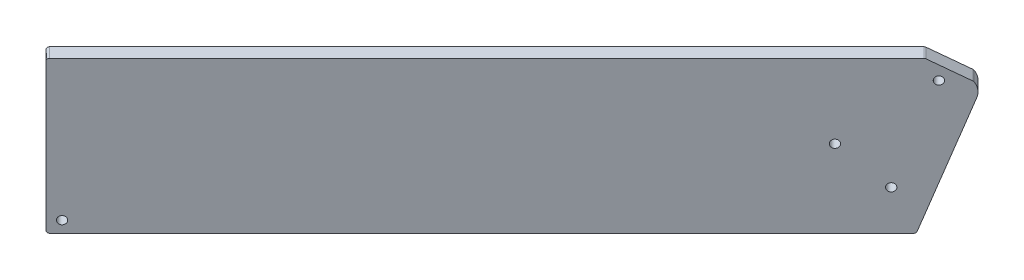
ISO-10303-21;
HEADER;
FILE_DESCRIPTION(('STEP AP214'),'2;1');
FILE_NAME('part.step','',(''),(''),'','','');
FILE_SCHEMA(('AUTOMOTIVE_DESIGN { 1 0 10303 214 1 1 1 1 }'));
ENDSEC;
DATA;
#1=APPLICATION_CONTEXT('core data for automotive mechanical design processes');
#2=APPLICATION_PROTOCOL_DEFINITION('international standard','automotive_design',2000,#1);
#3=PRODUCT_CONTEXT('',#1,'mechanical');
#4=PRODUCT('Part','Part','',(#3));
#5=PRODUCT_RELATED_PRODUCT_CATEGORY('part','',(#4));
#6=PRODUCT_DEFINITION_FORMATION('','',#4);
#7=PRODUCT_DEFINITION_CONTEXT('part definition',#1,'design');
#8=PRODUCT_DEFINITION('design','',#6,#7);
#9=PRODUCT_DEFINITION_SHAPE('','',#8);
#10=(LENGTH_UNIT() NAMED_UNIT(*) SI_UNIT(.MILLI.,.METRE.));
#11=(NAMED_UNIT(*) PLANE_ANGLE_UNIT() SI_UNIT($,.RADIAN.));
#12=(NAMED_UNIT(*) SI_UNIT($,.STERADIAN.) SOLID_ANGLE_UNIT());
#13=UNCERTAINTY_MEASURE_WITH_UNIT(LENGTH_MEASURE(1.E-05),#10,'distance_accuracy_value','');
#14=(GEOMETRIC_REPRESENTATION_CONTEXT(3) GLOBAL_UNCERTAINTY_ASSIGNED_CONTEXT((#13)) GLOBAL_UNIT_ASSIGNED_CONTEXT((#10,
#11,#12)) REPRESENTATION_CONTEXT('',''));
#15=CARTESIAN_POINT('',(0.,0.,0.));
#16=DIRECTION('',(0.,0.,1.));
#17=DIRECTION('',(1.,0.,0.));
#18=AXIS2_PLACEMENT_3D('',#15,#16,#17);
#19=CARTESIAN_POINT('',(1237.44296020864,124.968,-361.241491796263));
#20=DIRECTION('',(-0.707106781186546,0.,-0.707106781186549));
#21=DIRECTION('',(-0.707106781186549,0.,0.707106781186546));
#22=AXIS2_PLACEMENT_3D('',#19,#20,#21);
#23=CYLINDRICAL_SURFACE('',#22,2.03199999999998);
#24=CARTESIAN_POINT('',(1228.9576788344,124.968,-369.726773170502));
#25=DIRECTION('',(-0.707106781186546,0.,-0.707106781186549));
#26=DIRECTION('',(-0.707106781186549,0.,0.707106781186546));
#27=AXIS2_PLACEMENT_3D('',#24,#25,#26);
#28=CIRCLE('',#27,2.03199999999998);
#29=CARTESIAN_POINT('',(1229.67609932409,126.72776362049,-370.445193660187));
#30=VERTEX_POINT('',#29);
#31=CARTESIAN_POINT('',(1228.9576788344,127.,-369.726773170502));
#32=VERTEX_POINT('',#31);
#33=EDGE_CURVE('E92',#30,#32,#28,.F.);
#34=ORIENTED_EDGE('',*,*,#33,.T.);
#35=DIRECTION('',(0.707106781186552,0.,0.707106781186543));
#36=VECTOR('',#35,1.);
#37=CARTESIAN_POINT('',(1228.9576788344,127.,-369.726773170502));
#38=LINE('',#37,#36);
#39=CARTESIAN_POINT('',(1237.44296020864,127.,-361.241491796263));
#40=VERTEX_POINT('',#39);
#41=EDGE_CURVE('E106',#32,#40,#38,.T.);
#42=ORIENTED_EDGE('',*,*,#41,.T.);
#43=CARTESIAN_POINT('',(1237.44296020864,124.968,-361.241491796263));
#44=DIRECTION('',(-0.707106781186546,0.,-0.707106781186549));
#45=DIRECTION('',(-0.707106781186549,0.,0.707106781186546));
#46=AXIS2_PLACEMENT_3D('',#43,#44,#45);
#47=CIRCLE('',#46,2.03199999999998);
#48=CARTESIAN_POINT('',(1238.16138069832,126.72776362049,-361.959912285949));
#49=VERTEX_POINT('',#48);
#50=EDGE_CURVE('E20',#40,#49,#47,.T.);
#51=ORIENTED_EDGE('',*,*,#50,.T.);
#52=DIRECTION('',(-0.707106781186534,0.,-0.707106781186561));
#53=VECTOR('',#52,1.);
#54=CARTESIAN_POINT('',(1238.16138069832,126.72776362049,-361.959912285949));
#55=LINE('',#54,#53);
#56=EDGE_CURVE('E95',#49,#30,#55,.T.);
#57=ORIENTED_EDGE('',*,*,#56,.T.);
#58=EDGE_LOOP('',(#34,#42,#51,#57));
#59=FACE_BOUND('',#58,.T.);
#60=ADVANCED_FACE('F17',(#59),#23,.T.);
#61=CARTESIAN_POINT('',(429.615452831947,1.51770596090728E-13,429.615452831949));
#62=DIRECTION('',(0.707106781186546,0.,0.707106781186549));
#63=DIRECTION('',(0.707106781186549,0.,-0.707106781186546));
#64=AXIS2_PLACEMENT_3D('',#61,#62,#63);
#65=PLANE('',#64);
#66=ORIENTED_EDGE('',*,*,#33,.F.);
#67=DIRECTION('',(0.612372435695788,-0.50000000000001,-0.612372435695792));
#68=VECTOR('',#67,1.);
#69=CARTESIAN_POINT('',(1229.67609932409,126.72776362049,-370.445193660187));
#70=LINE('',#69,#68);
#71=CARTESIAN_POINT('',(1249.49101096678,110.548956012843,-390.260105302884));
#72=VERTEX_POINT('',#71);
#73=EDGE_CURVE('E88',#30,#72,#70,.T.);
#74=ORIENTED_EDGE('',*,*,#73,.T.);
#75=CARTESIAN_POINT('',(1248.7725904771,108.789192392353,-389.541684813198));
#76=DIRECTION('',(-0.707106781186546,0.,-0.707106781186549));
#77=DIRECTION('',(-0.707106781186549,0.,0.707106781186546));
#78=AXIS2_PLACEMENT_3D('',#75,#76,#77);
#79=CIRCLE('',#78,2.03199999999998);
#80=CARTESIAN_POINT('',(1249.95257674722,109.948627084198,-390.721671083319));
#81=VERTEX_POINT('',#80);
#82=EDGE_CURVE('E72',#81,#72,#79,.F.);
#83=ORIENTED_EDGE('',*,*,#82,.F.);
#84=CARTESIAN_POINT('',(1242.57766255896,102.702160260166,-383.346756895065));
#85=DIRECTION('',(-0.707106781186546,0.,-0.707106781186549));
#86=DIRECTION('',(-0.707106781186549,0.,0.707106781186546));
#87=AXIS2_PLACEMENT_3D('',#84,#85,#86);
#88=CIRCLE('',#87,12.7);
#89=CARTESIAN_POINT('',(1251.0163429687,98.3585044399299,-391.785437304801));
#90=VERTEX_POINT('',#89);
#91=EDGE_CURVE('E150',#90,#81,#88,.F.);
#92=ORIENTED_EDGE('',*,*,#91,.F.);
#93=DIRECTION('',(0.241844762647978,0.939692620785907,-0.241844762647977));
#94=VECTOR('',#93,1.);
#95=CARTESIAN_POINT('',(1132.57776360012,-361.836944204197,-273.346857936224));
#96=LINE('',#95,#94);
#97=CARTESIAN_POINT('',(1226.04632772148,1.33701506876224,-366.815422057582));
#98=VERTEX_POINT('',#97);
#99=EDGE_CURVE('E109',#90,#98,#96,.F.);
#100=ORIENTED_EDGE('',*,*,#99,.T.);
#101=CARTESIAN_POINT('',(1224.69613885592,2.03199999999998,-365.465233192025));
#102=DIRECTION('',(0.707106781186546,0.,0.707106781186549));
#103=DIRECTION('',(0.707106781186549,0.,-0.707106781186546));
#104=AXIS2_PLACEMENT_3D('',#101,#102,#103);
#105=CIRCLE('',#104,2.03199999999998);
#106=CARTESIAN_POINT('',(1224.69613885592,0.,-365.465233192025));
#107=VERTEX_POINT('',#106);
#108=EDGE_CURVE('E113',#107,#98,#105,.T.);
#109=ORIENTED_EDGE('',*,*,#108,.F.);
#110=DIRECTION('',(0.707106781186549,0.,-0.707106781186546));
#111=VECTOR('',#110,1.);
#112=CARTESIAN_POINT('',(862.317978549899,0.,-3.0870728860013));
#113=LINE('',#112,#111);
#114=CARTESIAN_POINT('',(862.317978549899,0.,-3.08707288600124));
#115=VERTEX_POINT('',#114);
#116=EDGE_CURVE('E114',#115,#107,#113,.T.);
#117=ORIENTED_EDGE('',*,*,#116,.F.);
#118=CARTESIAN_POINT('',(862.317978549899,2.032,-3.08707288600119));
#119=DIRECTION('',(0.707106781186546,0.,0.707106781186549));
#120=DIRECTION('',(0.707106781186549,0.,-0.707106781186546));
#121=AXIS2_PLACEMENT_3D('',#118,#119,#120);
#122=CIRCLE('',#121,2.03199999999997);
#123=CARTESIAN_POINT('',(860.881137570528,2.032,-1.65023190663016));
#124=VERTEX_POINT('',#123);
#125=EDGE_CURVE('E154',#124,#115,#122,.T.);
#126=ORIENTED_EDGE('',*,*,#125,.F.);
#127=DIRECTION('',(0.,1.,0.));
#128=VECTOR('',#127,1.);
#129=CARTESIAN_POINT('',(860.881137570528,1.53435930627666E-13,-1.65023190663015));
#130=LINE('',#129,#128);
#131=CARTESIAN_POINT('',(860.881137570528,124.968,-1.65023190663011));
#132=VERTEX_POINT('',#131);
#133=EDGE_CURVE('E119',#124,#132,#130,.T.);
#134=ORIENTED_EDGE('',*,*,#133,.T.);
#135=CARTESIAN_POINT('',(862.317978549899,124.968,-3.08707288600111));
#136=DIRECTION('',(-0.707106781186546,0.,-0.707106781186549));
#137=DIRECTION('',(-0.707106781186549,0.,0.707106781186546));
#138=AXIS2_PLACEMENT_3D('',#135,#136,#137);
#139=CIRCLE('',#138,2.03199999999997);
#140=CARTESIAN_POINT('',(862.317978549899,127.,-3.08707288600111));
#141=VERTEX_POINT('',#140);
#142=EDGE_CURVE('E123',#141,#132,#139,.F.);
#143=ORIENTED_EDGE('',*,*,#142,.F.);
#144=DIRECTION('',(0.707106781186549,0.,-0.707106781186546));
#145=VECTOR('',#144,1.);
#146=CARTESIAN_POINT('',(862.317978549899,127.,-3.08707288600124));
#147=LINE('',#146,#145);
#148=EDGE_CURVE('E94',#141,#32,#147,.T.);
#149=ORIENTED_EDGE('',*,*,#148,.T.);
#150=EDGE_LOOP('',(#66,#74,#83,#92,#100,#109,#117,#126,#134,#143,#149));
#151=FACE_BOUND('',#150,.T.);
#152=CARTESIAN_POINT('',(1191.59579018666,65.0166698736605,-332.364884522763));
#153=DIRECTION('',(-0.707106781186546,0.,-0.707106781186549));
#154=DIRECTION('',(-0.707106781186549,0.,0.707106781186546));
#155=AXIS2_PLACEMENT_3D('',#152,#153,#154);
#156=CIRCLE('',#155,3.35279999999997);
#157=CARTESIAN_POINT('',(1189.2250025707,65.0166698736605,-329.994096906801));
#158=VERTEX_POINT('',#157);
#159=EDGE_CURVE('E99',#158,#158,#156,.F.);
#160=ORIENTED_EDGE('',*,*,#159,.T.);
#161=EDGE_LOOP('',(#160));
#162=FACE_BOUND('',#161,.T.);
#163=CARTESIAN_POINT('',(1235.14419067495,110.951573739276,-375.913285011051));
#164=DIRECTION('',(-0.707106781186546,0.,-0.707106781186549));
#165=DIRECTION('',(-0.707106781186549,0.,0.707106781186546));
#166=AXIS2_PLACEMENT_3D('',#163,#164,#165);
#167=CIRCLE('',#166,3.35279999999833);
#168=CARTESIAN_POINT('',(1232.77340305899,110.951573739276,-373.54249739509));
#169=VERTEX_POINT('',#168);
#170=EDGE_CURVE('E103',#169,#169,#167,.F.);
#171=ORIENTED_EDGE('',*,*,#170,.T.);
#172=EDGE_LOOP('',(#171));
#173=FACE_BOUND('',#172,.T.);
#174=CARTESIAN_POINT('',(1215.17990551836,33.3799478933991,-355.94899985446));
#175=DIRECTION('',(-0.707106781186546,0.,-0.707106781186549));
#176=DIRECTION('',(-0.707106781186549,0.,0.707106781186546));
#177=AXIS2_PLACEMENT_3D('',#174,#175,#176);
#178=CIRCLE('',#177,3.35279999999997);
#179=CARTESIAN_POINT('',(1212.8091179024,33.3799478933991,-353.578212238497));
#180=VERTEX_POINT('',#179);
#181=EDGE_CURVE('E163',#180,#180,#178,.F.);
#182=ORIENTED_EDGE('',*,*,#181,.T.);
#183=EDGE_LOOP('',(#182));
#184=FACE_BOUND('',#183,.T.);
#185=CARTESIAN_POINT('',(867.61632966133,9.52499999999993,-8.38542399743178));
#186=DIRECTION('',(0.707106781186546,0.,0.707106781186549));
#187=DIRECTION('',(0.707106781186549,0.,-0.707106781186546));
#188=AXIS2_PLACEMENT_3D('',#185,#186,#187);
#189=CIRCLE('',#188,3.35280000000009);
#190=CARTESIAN_POINT('',(869.987117277292,9.52499999999993,-10.7562116133941));
#191=VERTEX_POINT('',#190);
#192=EDGE_CURVE('E84',#191,#191,#189,.T.);
#193=ORIENTED_EDGE('',*,*,#192,.T.);
#194=EDGE_LOOP('',(#193));
#195=FACE_BOUND('',#194,.T.);
#196=ADVANCED_FACE('F89',(#151,#162,#173,#184,#195),#65,.F.);
#197=CARTESIAN_POINT('',(1257.25787185134,108.789192392353,-381.056403438959));
#198=DIRECTION('',(-0.707106781186546,0.,-0.707106781186549));
#199=DIRECTION('',(-0.707106781186549,0.,0.707106781186546));
#200=AXIS2_PLACEMENT_3D('',#197,#198,#199);
#201=CYLINDRICAL_SURFACE('',#200,2.03199999999998);
#202=ORIENTED_EDGE('',*,*,#82,.T.);
#203=DIRECTION('',(0.707106781186557,0.,0.707106781186538));
#204=VECTOR('',#203,1.);
#205=CARTESIAN_POINT('',(1249.49101096678,110.548956012843,-390.260105302884));
#206=LINE('',#205,#204);
#207=CARTESIAN_POINT('',(1257.97629234102,110.548956012843,-381.774823928645));
#208=VERTEX_POINT('',#207);
#209=EDGE_CURVE('E80',#72,#208,#206,.T.);
#210=ORIENTED_EDGE('',*,*,#209,.T.);
#211=CARTESIAN_POINT('',(1257.25787185134,108.789192392353,-381.056403438959));
#212=DIRECTION('',(-0.707106781186546,0.,-0.707106781186549));
#213=DIRECTION('',(-0.707106781186549,0.,0.707106781186546));
#214=AXIS2_PLACEMENT_3D('',#211,#212,#213);
#215=CIRCLE('',#214,2.03199999999998);
#216=CARTESIAN_POINT('',(1258.43785812146,109.948627084198,-382.23638970908));
#217=VERTEX_POINT('',#216);
#218=EDGE_CURVE('E35',#208,#217,#215,.T.);
#219=ORIENTED_EDGE('',*,*,#218,.T.);
#220=DIRECTION('',(-0.707106781186546,0.,-0.707106781186549));
#221=VECTOR('',#220,1.);
#222=CARTESIAN_POINT('',(1258.43785812146,109.948627084198,-382.23638970908));
#223=LINE('',#222,#221);
#224=EDGE_CURVE('E82',#81,#217,#223,.F.);
#225=ORIENTED_EDGE('',*,*,#224,.F.);
#226=EDGE_LOOP('',(#202,#210,#219,#225));
#227=FACE_BOUND('',#226,.T.);
#228=ADVANCED_FACE('F78',(#227),#201,.T.);
#229=CARTESIAN_POINT('',(672.277939106578,9.52499999999986,-203.723814552185));
#230=DIRECTION('',(0.707106781186546,0.,0.707106781186549));
#231=DIRECTION('',(0.707106781186549,0.,-0.707106781186546));
#232=AXIS2_PLACEMENT_3D('',#229,#230,#231);
#233=CYLINDRICAL_SURFACE('',#232,3.35280000000009);
#234=CARTESIAN_POINT('',(876.101611035568,9.52499999999994,0.0998573768066779));
#235=DIRECTION('',(0.707106781186546,0.,0.707106781186549));
#236=DIRECTION('',(0.707106781186549,0.,-0.707106781186546));
#237=AXIS2_PLACEMENT_3D('',#234,#235,#236);
#238=CIRCLE('',#237,3.35280000000009);
#239=CARTESIAN_POINT('',(878.472398651531,9.52499999999994,-2.27093023915564));
#240=VERTEX_POINT('',#239);
#241=EDGE_CURVE('E146',#240,#240,#238,.F.);
#242=ORIENTED_EDGE('',*,*,#241,.F.);
#243=EDGE_LOOP('',(#242));
#244=FACE_BOUND('',#243,.T.);
#245=ORIENTED_EDGE('',*,*,#192,.F.);
#246=EDGE_LOOP('',(#245));
#247=FACE_BOUND('',#246,.T.);
#248=ADVANCED_FACE('F350',(#244,#247),#233,.F.);
#249=CARTESIAN_POINT('',(1223.6651868926,33.3799478933991,-347.463718480221));
#250=DIRECTION('',(-0.707106781186546,0.,-0.707106781186549));
#251=DIRECTION('',(-0.707106781186549,0.,0.707106781186546));
#252=AXIS2_PLACEMENT_3D('',#249,#250,#251);
#253=CYLINDRICAL_SURFACE('',#252,3.35279999999997);
#254=ORIENTED_EDGE('',*,*,#181,.F.);
#255=EDGE_LOOP('',(#254));
#256=FACE_BOUND('',#255,.T.);
#257=CARTESIAN_POINT('',(1223.6651868926,33.3799478933991,-347.463718480221));
#258=DIRECTION('',(-0.707106781186546,0.,-0.707106781186549));
#259=DIRECTION('',(-0.707106781186549,0.,0.707106781186546));
#260=AXIS2_PLACEMENT_3D('',#257,#258,#259);
#261=CIRCLE('',#260,3.35279999999997);
#262=CARTESIAN_POINT('',(1221.29439927664,33.3799478933991,-345.092930864259));
#263=VERTEX_POINT('',#262);
#264=EDGE_CURVE('E143',#263,#263,#261,.T.);
#265=ORIENTED_EDGE('',*,*,#264,.F.);
#266=EDGE_LOOP('',(#265));
#267=FACE_BOUND('',#266,.T.);
#268=ADVANCED_FACE('F340',(#256,#267),#253,.F.);
#269=CARTESIAN_POINT('',(1243.62947204919,110.951573739276,-367.428003636812));
#270=DIRECTION('',(-0.707106781186546,0.,-0.707106781186549));
#271=DIRECTION('',(-0.707106781186549,0.,0.707106781186546));
#272=AXIS2_PLACEMENT_3D('',#269,#270,#271);
#273=CYLINDRICAL_SURFACE('',#272,3.35279999999833);
#274=ORIENTED_EDGE('',*,*,#170,.F.);
#275=EDGE_LOOP('',(#274));
#276=FACE_BOUND('',#275,.T.);
#277=CARTESIAN_POINT('',(1243.62947204919,110.951573739276,-367.428003636812));
#278=DIRECTION('',(-0.707106781186546,0.,-0.707106781186549));
#279=DIRECTION('',(-0.707106781186549,0.,0.707106781186546));
#280=AXIS2_PLACEMENT_3D('',#277,#278,#279);
#281=CIRCLE('',#280,3.35279999999833);
#282=CARTESIAN_POINT('',(1241.25868443323,110.951573739276,-365.057216020851));
#283=VERTEX_POINT('',#282);
#284=EDGE_CURVE('E140',#283,#283,#281,.T.);
#285=ORIENTED_EDGE('',*,*,#284,.F.);
#286=EDGE_LOOP('',(#285));
#287=FACE_BOUND('',#286,.T.);
#288=ADVANCED_FACE('F330',(#276,#287),#273,.F.);
#289=CARTESIAN_POINT('',(1200.0810715609,65.0166698736605,-323.879603148524));
#290=DIRECTION('',(-0.707106781186546,0.,-0.707106781186549));
#291=DIRECTION('',(-0.707106781186549,0.,0.707106781186546));
#292=AXIS2_PLACEMENT_3D('',#289,#290,#291);
#293=CYLINDRICAL_SURFACE('',#292,3.35279999999997);
#294=ORIENTED_EDGE('',*,*,#159,.F.);
#295=EDGE_LOOP('',(#294));
#296=FACE_BOUND('',#295,.T.);
#297=CARTESIAN_POINT('',(1200.0810715609,65.0166698736605,-323.879603148524));
#298=DIRECTION('',(-0.707106781186546,0.,-0.707106781186549));
#299=DIRECTION('',(-0.707106781186549,0.,0.707106781186546));
#300=AXIS2_PLACEMENT_3D('',#297,#298,#299);
#301=CIRCLE('',#300,3.35279999999997);
#302=CARTESIAN_POINT('',(1197.71028394494,65.0166698736605,-321.508815532562));
#303=VERTEX_POINT('',#302);
#304=EDGE_CURVE('E137',#303,#303,#301,.T.);
#305=ORIENTED_EDGE('',*,*,#304,.F.);
#306=EDGE_LOOP('',(#305));
#307=FACE_BOUND('',#306,.T.);
#308=ADVANCED_FACE('F321',(#296,#307),#293,.F.);
#309=CARTESIAN_POINT('',(676.918190468507,584.980909512114,199.283277943867));
#310=DIRECTION('',(-0.353553390593279,-0.866025403784435,0.353553390593278));
#311=DIRECTION('',(0.925820099772549,-0.377964473009234,0.));
#312=AXIS2_PLACEMENT_3D('',#309,#310,#311);
#313=PLANE('',#312);
#314=ORIENTED_EDGE('',*,*,#56,.F.);
#315=DIRECTION('',(-0.61237243569579,0.500000000000006,0.612372435695794));
#316=VECTOR('',#315,1.);
#317=CARTESIAN_POINT('',(1257.97629234102,110.548956012843,-381.774823928645));
#318=LINE('',#317,#316);
#319=EDGE_CURVE('E98',#208,#49,#318,.T.);
#320=ORIENTED_EDGE('',*,*,#319,.F.);
#321=ORIENTED_EDGE('',*,*,#209,.F.);
#322=ORIENTED_EDGE('',*,*,#73,.F.);
#323=EDGE_LOOP('',(#314,#320,#321,#322));
#324=FACE_BOUND('',#323,.T.);
#325=ADVANCED_FACE('F97',(#324),#313,.F.);
#326=CARTESIAN_POINT('',(438.100734206186,127.,438.100734206187));
#327=DIRECTION('',(0.,-1.,0.));
#328=DIRECTION('',(1.,0.,0.));
#329=AXIS2_PLACEMENT_3D('',#326,#327,#328);
#330=PLANE('',#329);
#331=ORIENTED_EDGE('',*,*,#41,.F.);
#332=ORIENTED_EDGE('',*,*,#148,.F.);
#333=DIRECTION('',(-0.707106781186546,0.,-0.707106781186549));
#334=VECTOR('',#333,1.);
#335=CARTESIAN_POINT('',(870.803259924137,127.,5.39820848823735));
#336=LINE('',#335,#334);
#337=CARTESIAN_POINT('',(870.803259924138,127.,5.39820848823739));
#338=VERTEX_POINT('',#337);
#339=EDGE_CURVE('E159',#338,#141,#336,.T.);
#340=ORIENTED_EDGE('',*,*,#339,.F.);
#341=DIRECTION('',(0.707106781186549,0.,-0.707106781186546));
#342=VECTOR('',#341,1.);
#343=CARTESIAN_POINT('',(438.100734206186,127.,438.100734206187));
#344=LINE('',#343,#342);
#345=EDGE_CURVE('E136',#40,#338,#344,.F.);
#346=ORIENTED_EDGE('',*,*,#345,.F.);
#347=EDGE_LOOP('',(#331,#332,#340,#346));
#348=FACE_BOUND('',#347,.T.);
#349=ADVANCED_FACE('F174',(#348),#330,.F.);
#350=CARTESIAN_POINT('',(870.803259924137,124.968,5.39820848823735));
#351=DIRECTION('',(-0.707106781186546,0.,-0.707106781186549));
#352=DIRECTION('',(-0.707106781186549,0.,0.707106781186546));
#353=AXIS2_PLACEMENT_3D('',#350,#351,#352);
#354=CYLINDRICAL_SURFACE('',#353,2.03199999999997);
#355=ORIENTED_EDGE('',*,*,#142,.T.);
#356=DIRECTION('',(-0.707106781186546,0.,-0.707106781186549));
#357=VECTOR('',#356,1.);
#358=CARTESIAN_POINT('',(869.366418944766,124.968,6.83504946760842));
#359=LINE('',#358,#357);
#360=CARTESIAN_POINT('',(869.366418944767,124.968,6.83504946760839));
#361=VERTEX_POINT('',#360);
#362=EDGE_CURVE('E122',#132,#361,#359,.F.);
#363=ORIENTED_EDGE('',*,*,#362,.T.);
#364=CARTESIAN_POINT('',(870.803259924137,124.968,5.39820848823736));
#365=DIRECTION('',(-0.707106781186546,0.,-0.707106781186549));
#366=DIRECTION('',(-0.707106781186549,0.,0.707106781186546));
#367=AXIS2_PLACEMENT_3D('',#364,#365,#366);
#368=CIRCLE('',#367,2.03199999999997);
#369=EDGE_CURVE('E133',#338,#361,#368,.F.);
#370=ORIENTED_EDGE('',*,*,#369,.F.);
#371=ORIENTED_EDGE('',*,*,#339,.T.);
#372=EDGE_LOOP('',(#355,#363,#370,#371));
#373=FACE_BOUND('',#372,.T.);
#374=ADVANCED_FACE('F231',(#373),#354,.T.);
#375=CARTESIAN_POINT('',(869.366418944766,1.53435930627666E-13,6.83504946760842));
#376=DIRECTION('',(0.707106781186549,0.,-0.707106781186546));
#377=DIRECTION('',(-0.707106781186546,0.,-0.707106781186549));
#378=AXIS2_PLACEMENT_3D('',#375,#376,#377);
#379=PLANE('',#378);
#380=ORIENTED_EDGE('',*,*,#362,.F.);
#381=ORIENTED_EDGE('',*,*,#133,.F.);
#382=DIRECTION('',(0.707106781186546,0.,0.707106781186549));
#383=VECTOR('',#382,1.);
#384=CARTESIAN_POINT('',(869.366418944766,2.032,6.8350494676084));
#385=LINE('',#384,#383);
#386=CARTESIAN_POINT('',(869.366418944767,2.032,6.8350494676084));
#387=VERTEX_POINT('',#386);
#388=EDGE_CURVE('E157',#387,#124,#385,.F.);
#389=ORIENTED_EDGE('',*,*,#388,.F.);
#390=DIRECTION('',(0.,1.,0.));
#391=VECTOR('',#390,1.);
#392=CARTESIAN_POINT('',(869.366418944767,1.53435930627666E-13,6.83504946760843));
#393=LINE('',#392,#391);
#394=EDGE_CURVE('E132',#361,#387,#393,.F.);
#395=ORIENTED_EDGE('',*,*,#394,.F.);
#396=EDGE_LOOP('',(#380,#381,#389,#395));
#397=FACE_BOUND('',#396,.T.);
#398=ADVANCED_FACE('F233',(#397),#379,.F.);
#399=CARTESIAN_POINT('',(870.803259924137,2.032,5.39820848823735));
#400=DIRECTION('',(0.707106781186546,0.,0.707106781186549));
#401=DIRECTION('',(0.707106781186549,0.,-0.707106781186546));
#402=AXIS2_PLACEMENT_3D('',#399,#400,#401);
#403=CYLINDRICAL_SURFACE('',#402,2.03199999999997);
#404=ORIENTED_EDGE('',*,*,#125,.T.);
#405=DIRECTION('',(-0.707106781186534,0.,-0.707106781186561));
#406=VECTOR('',#405,1.);
#407=CARTESIAN_POINT('',(870.803259924137,0.,5.39820848823735));
#408=LINE('',#407,#406);
#409=CARTESIAN_POINT('',(870.803259924138,0.,5.39820848823739));
#410=VERTEX_POINT('',#409);
#411=EDGE_CURVE('E118',#410,#115,#408,.T.);
#412=ORIENTED_EDGE('',*,*,#411,.F.);
#413=CARTESIAN_POINT('',(870.803259924137,2.032,5.39820848823734));
#414=DIRECTION('',(0.707106781186546,0.,0.707106781186549));
#415=DIRECTION('',(0.707106781186549,0.,-0.707106781186546));
#416=AXIS2_PLACEMENT_3D('',#413,#414,#415);
#417=CIRCLE('',#416,2.03199999999997);
#418=EDGE_CURVE('E129',#387,#410,#417,.T.);
#419=ORIENTED_EDGE('',*,*,#418,.F.);
#420=ORIENTED_EDGE('',*,*,#388,.T.);
#421=EDGE_LOOP('',(#404,#412,#419,#420));
#422=FACE_BOUND('',#421,.T.);
#423=ADVANCED_FACE('F237',(#422),#403,.T.);
#424=CARTESIAN_POINT('',(438.100734206186,0.,438.100734206187));
#425=DIRECTION('',(0.,-1.,0.));
#426=DIRECTION('',(0.,0.,-1.));
#427=AXIS2_PLACEMENT_3D('',#424,#425,#426);
#428=PLANE('',#427);
#429=ORIENTED_EDGE('',*,*,#116,.T.);
#430=DIRECTION('',(0.707106781186546,0.,0.707106781186549));
#431=VECTOR('',#430,1.);
#432=CARTESIAN_POINT('',(1233.18142023016,0.,-356.979951817786));
#433=LINE('',#432,#431);
#434=CARTESIAN_POINT('',(1233.18142023016,0.,-356.979951817786));
#435=VERTEX_POINT('',#434);
#436=EDGE_CURVE('E117',#435,#107,#433,.F.);
#437=ORIENTED_EDGE('',*,*,#436,.F.);
#438=DIRECTION('',(0.707106781186549,0.,-0.707106781186546));
#439=VECTOR('',#438,1.);
#440=CARTESIAN_POINT('',(438.100734206186,0.,438.100734206187));
#441=LINE('',#440,#439);
#442=EDGE_CURVE('E128',#410,#435,#441,.T.);
#443=ORIENTED_EDGE('',*,*,#442,.F.);
#444=ORIENTED_EDGE('',*,*,#411,.T.);
#445=EDGE_LOOP('',(#429,#437,#443,#444));
#446=FACE_BOUND('',#445,.T.);
#447=ADVANCED_FACE('F239',(#446),#428,.T.);
#448=CARTESIAN_POINT('',(1233.18142023016,2.03199999999998,-356.979951817786));
#449=DIRECTION('',(0.707106781186546,0.,0.707106781186549));
#450=DIRECTION('',(0.707106781186549,0.,-0.707106781186546));
#451=AXIS2_PLACEMENT_3D('',#448,#449,#450);
#452=CYLINDRICAL_SURFACE('',#451,2.03199999999998);
#453=ORIENTED_EDGE('',*,*,#108,.T.);
#454=DIRECTION('',(0.707106781186546,0.,0.707106781186549));
#455=VECTOR('',#454,1.);
#456=CARTESIAN_POINT('',(1234.53160909572,1.33701506876227,-358.330140683344));
#457=LINE('',#456,#455);
#458=CARTESIAN_POINT('',(1234.53160909572,1.33701506876225,-358.330140683344));
#459=VERTEX_POINT('',#458);
#460=EDGE_CURVE('E112',#98,#459,#457,.T.);
#461=ORIENTED_EDGE('',*,*,#460,.T.);
#462=CARTESIAN_POINT('',(1233.18142023016,2.03199999999998,-356.979951817786));
#463=DIRECTION('',(0.707106781186546,0.,0.707106781186549));
#464=DIRECTION('',(0.707106781186549,0.,-0.707106781186546));
#465=AXIS2_PLACEMENT_3D('',#462,#463,#464);
#466=CIRCLE('',#465,2.03199999999998);
#467=EDGE_CURVE('E125',#435,#459,#466,.T.);
#468=ORIENTED_EDGE('',*,*,#467,.F.);
#469=ORIENTED_EDGE('',*,*,#436,.T.);
#470=EDGE_LOOP('',(#453,#461,#468,#469));
#471=FACE_BOUND('',#470,.T.);
#472=ADVANCED_FACE('F241',(#471),#452,.T.);
#473=CARTESIAN_POINT('',(1141.06304497436,-361.836944204197,-264.861576561985));
#474=DIRECTION('',(-0.664463024388675,0.342020143325672,0.664463024388673));
#475=DIRECTION('',(0.707106781186546,0.,0.707106781186549));
#476=AXIS2_PLACEMENT_3D('',#473,#474,#475);
#477=PLANE('',#476);
#478=ORIENTED_EDGE('',*,*,#460,.F.);
#479=ORIENTED_EDGE('',*,*,#99,.F.);
#480=DIRECTION('',(-0.707106781186546,0.,-0.707106781186549));
#481=VECTOR('',#480,1.);
#482=CARTESIAN_POINT('',(1259.50162434294,98.35850443993,-383.300155930563));
#483=LINE('',#482,#481);
#484=CARTESIAN_POINT('',(1259.50162434294,98.3585044399299,-383.300155930563));
#485=VERTEX_POINT('',#484);
#486=EDGE_CURVE('E149',#485,#90,#483,.T.);
#487=ORIENTED_EDGE('',*,*,#486,.F.);
#488=DIRECTION('',(0.241844762647979,0.939692620785907,-0.241844762647976));
#489=VECTOR('',#488,1.);
#490=CARTESIAN_POINT('',(1234.53160909572,1.33701506876222,-358.330140683344));
#491=LINE('',#490,#489);
#492=EDGE_CURVE('E26',#459,#485,#491,.T.);
#493=ORIENTED_EDGE('',*,*,#492,.F.);
#494=EDGE_LOOP('',(#478,#479,#487,#493));
#495=FACE_BOUND('',#494,.T.);
#496=ADVANCED_FACE('F205',(#495),#477,.F.);
#497=CARTESIAN_POINT('',(1251.0629439332,102.702160260166,-374.861475520827));
#498=DIRECTION('',(-0.707106781186546,0.,-0.707106781186549));
#499=DIRECTION('',(-0.707106781186549,0.,0.707106781186546));
#500=AXIS2_PLACEMENT_3D('',#497,#498,#499);
#501=CYLINDRICAL_SURFACE('',#500,12.7);
#502=CARTESIAN_POINT('',(1251.0629439332,102.702160260166,-374.861475520827));
#503=DIRECTION('',(-0.707106781186546,0.,-0.707106781186549));
#504=DIRECTION('',(-0.707106781186549,0.,0.707106781186546));
#505=AXIS2_PLACEMENT_3D('',#502,#503,#504);
#506=CIRCLE('',#505,12.7);
#507=EDGE_CURVE('E11',#485,#217,#506,.F.);
#508=ORIENTED_EDGE('',*,*,#507,.F.);
#509=ORIENTED_EDGE('',*,*,#486,.T.);
#510=ORIENTED_EDGE('',*,*,#91,.T.);
#511=ORIENTED_EDGE('',*,*,#224,.T.);
#512=EDGE_LOOP('',(#508,#509,#510,#511));
#513=FACE_BOUND('',#512,.T.);
#514=ADVANCED_FACE('F249',(#513),#501,.T.);
#515=CARTESIAN_POINT('',(438.100734206186,1.53435930627666E-13,438.100734206187));
#516=DIRECTION('',(0.707106781186546,0.,0.707106781186549));
#517=DIRECTION('',(0.707106781186549,0.,-0.707106781186546));
#518=AXIS2_PLACEMENT_3D('',#515,#516,#517);
#519=PLANE('',#518);
#520=ORIENTED_EDGE('',*,*,#507,.T.);
#521=ORIENTED_EDGE('',*,*,#218,.F.);
#522=ORIENTED_EDGE('',*,*,#319,.T.);
#523=ORIENTED_EDGE('',*,*,#50,.F.);
#524=ORIENTED_EDGE('',*,*,#345,.T.);
#525=ORIENTED_EDGE('',*,*,#369,.T.);
#526=ORIENTED_EDGE('',*,*,#394,.T.);
#527=ORIENTED_EDGE('',*,*,#418,.T.);
#528=ORIENTED_EDGE('',*,*,#442,.T.);
#529=ORIENTED_EDGE('',*,*,#467,.T.);
#530=ORIENTED_EDGE('',*,*,#492,.T.);
#531=EDGE_LOOP('',(#520,#521,#522,#523,#524,#525,#526,#527,#528,#529,#530));
#532=FACE_BOUND('',#531,.T.);
#533=ORIENTED_EDGE('',*,*,#304,.T.);
#534=EDGE_LOOP('',(#533));
#535=FACE_BOUND('',#534,.T.);
#536=ORIENTED_EDGE('',*,*,#284,.T.);
#537=EDGE_LOOP('',(#536));
#538=FACE_BOUND('',#537,.T.);
#539=ORIENTED_EDGE('',*,*,#264,.T.);
#540=EDGE_LOOP('',(#539));
#541=FACE_BOUND('',#540,.T.);
#542=ORIENTED_EDGE('',*,*,#241,.T.);
#543=EDGE_LOOP('',(#542));
#544=FACE_BOUND('',#543,.T.);
#545=ADVANCED_FACE('F199',(#532,#535,#538,#541,#544),#519,.T.);
#546=CLOSED_SHELL('',(#60,#196,#228,#248,#268,#288,#308,#325,#349,#374,#398,#423,#447,#472,#496,
#514,#545));
#547=MANIFOLD_SOLID_BREP('B1',#546);
#548=ADVANCED_BREP_SHAPE_REPRESENTATION('',(#18,#547),#14);
#549=SHAPE_DEFINITION_REPRESENTATION(#9,#548);
ENDSEC;
END-ISO-10303-21;
